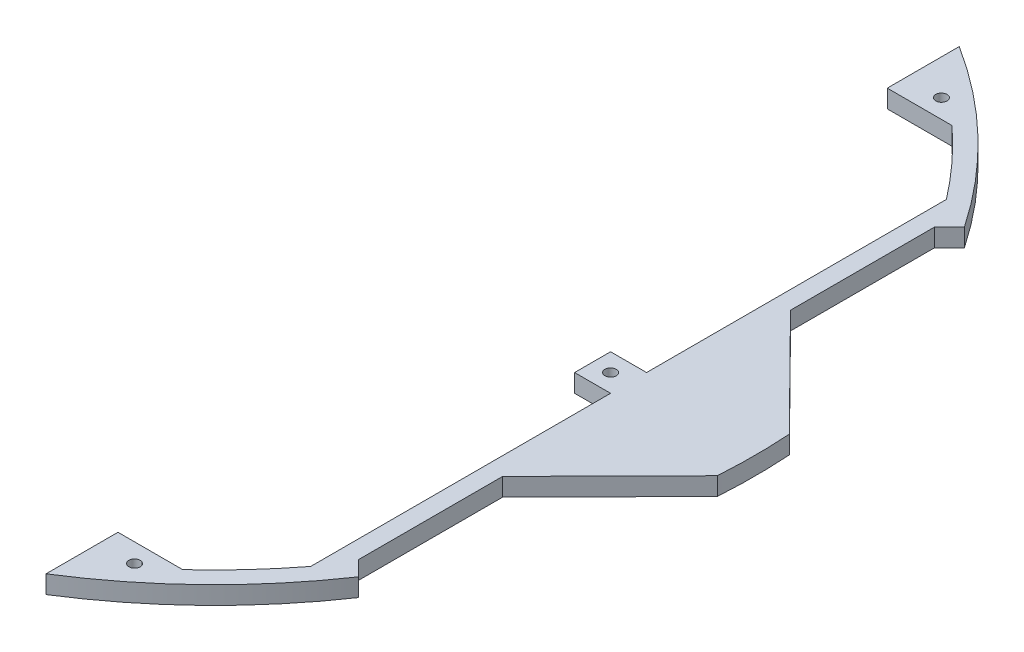
ISO-10303-21;
HEADER;
FILE_DESCRIPTION(('STEP AP214'),'2;1');
FILE_NAME('part.step','',(''),(''),'','','');
FILE_SCHEMA(('AUTOMOTIVE_DESIGN { 1 0 10303 214 1 1 1 1 }'));
ENDSEC;
DATA;
#1=APPLICATION_CONTEXT('core data for automotive mechanical design processes');
#2=APPLICATION_PROTOCOL_DEFINITION('international standard','automotive_design',2000,#1);
#3=PRODUCT_CONTEXT('',#1,'mechanical');
#4=PRODUCT('Part','Part','',(#3));
#5=PRODUCT_RELATED_PRODUCT_CATEGORY('part','',(#4));
#6=PRODUCT_DEFINITION_FORMATION('','',#4);
#7=PRODUCT_DEFINITION_CONTEXT('part definition',#1,'design');
#8=PRODUCT_DEFINITION('design','',#6,#7);
#9=PRODUCT_DEFINITION_SHAPE('','',#8);
#10=(LENGTH_UNIT() NAMED_UNIT(*) SI_UNIT(.MILLI.,.METRE.));
#11=(NAMED_UNIT(*) PLANE_ANGLE_UNIT() SI_UNIT($,.RADIAN.));
#12=(NAMED_UNIT(*) SI_UNIT($,.STERADIAN.) SOLID_ANGLE_UNIT());
#13=UNCERTAINTY_MEASURE_WITH_UNIT(LENGTH_MEASURE(1.E-05),#10,'distance_accuracy_value','');
#14=(GEOMETRIC_REPRESENTATION_CONTEXT(3) GLOBAL_UNCERTAINTY_ASSIGNED_CONTEXT((#13)) GLOBAL_UNIT_ASSIGNED_CONTEXT((#10,
#11,#12)) REPRESENTATION_CONTEXT('',''));
#15=CARTESIAN_POINT('',(0.,0.,0.));
#16=DIRECTION('',(0.,0.,1.));
#17=DIRECTION('',(1.,0.,0.));
#18=AXIS2_PLACEMENT_3D('',#15,#16,#17);
#19=CARTESIAN_POINT('',(133.35,6.35,-6.35000000000048));
#20=DIRECTION('',(1.,0.,0.));
#21=DIRECTION('',(0.,0.,-1.));
#22=AXIS2_PLACEMENT_3D('',#19,#20,#21);
#23=PLANE('',#22);
#24=DIRECTION('',(0.,0.,1.));
#25=VECTOR('',#24,1.);
#26=CARTESIAN_POINT('',(133.35,0.,-6.35000000000048));
#27=LINE('',#26,#25);
#28=CARTESIAN_POINT('',(133.35,0.,-6.35000000000048));
#29=VERTEX_POINT('',#28);
#30=CARTESIAN_POINT('',(133.35,0.,6.34999999999981));
#31=VERTEX_POINT('',#30);
#32=EDGE_CURVE('E203',#29,#31,#27,.T.);
#33=ORIENTED_EDGE('',*,*,#32,.T.);
#34=DIRECTION('',(0.,-1.,0.));
#35=VECTOR('',#34,1.);
#36=CARTESIAN_POINT('',(133.35,6.35,6.34999999999981));
#37=LINE('',#36,#35);
#38=CARTESIAN_POINT('',(133.35,6.35,6.34999999999981));
#39=VERTEX_POINT('',#38);
#40=EDGE_CURVE('E11',#39,#31,#37,.T.);
#41=ORIENTED_EDGE('',*,*,#40,.F.);
#42=DIRECTION('',(0.,0.,1.));
#43=VECTOR('',#42,1.);
#44=CARTESIAN_POINT('',(133.35,6.35,-6.35000000000048));
#45=LINE('',#44,#43);
#46=CARTESIAN_POINT('',(133.35,6.35,-6.35000000000048));
#47=VERTEX_POINT('',#46);
#48=EDGE_CURVE('E253',#47,#39,#45,.T.);
#49=ORIENTED_EDGE('',*,*,#48,.F.);
#50=DIRECTION('',(0.,-1.,0.));
#51=VECTOR('',#50,1.);
#52=CARTESIAN_POINT('',(133.35,6.35,-6.35000000000048));
#53=LINE('',#52,#51);
#54=EDGE_CURVE('E51',#47,#29,#53,.T.);
#55=ORIENTED_EDGE('',*,*,#54,.T.);
#56=EDGE_LOOP('',(#33,#41,#49,#55));
#57=FACE_BOUND('',#56,.T.);
#58=ADVANCED_FACE('F35',(#57),#23,.F.);
#59=CARTESIAN_POINT('',(133.35,6.35,6.34999999999981));
#60=DIRECTION('',(0.,0.,-1.));
#61=DIRECTION('',(-1.,0.,0.));
#62=AXIS2_PLACEMENT_3D('',#59,#60,#61);
#63=PLANE('',#62);
#64=DIRECTION('',(1.,0.,0.));
#65=VECTOR('',#64,1.);
#66=CARTESIAN_POINT('',(133.35,0.,6.34999999999981));
#67=LINE('',#66,#65);
#68=CARTESIAN_POINT('',(146.05,0.,6.34999999999981));
#69=VERTEX_POINT('',#68);
#70=EDGE_CURVE('E205',#31,#69,#67,.T.);
#71=ORIENTED_EDGE('',*,*,#70,.T.);
#72=DIRECTION('',(0.,-1.,0.));
#73=VECTOR('',#72,1.);
#74=CARTESIAN_POINT('',(146.05,6.35,6.34999999999981));
#75=LINE('',#74,#73);
#76=CARTESIAN_POINT('',(146.05,6.35,6.34999999999981));
#77=VERTEX_POINT('',#76);
#78=EDGE_CURVE('E43',#77,#69,#75,.T.);
#79=ORIENTED_EDGE('',*,*,#78,.F.);
#80=DIRECTION('',(1.,0.,0.));
#81=VECTOR('',#80,1.);
#82=CARTESIAN_POINT('',(133.35,6.35,6.34999999999981));
#83=LINE('',#82,#81);
#84=EDGE_CURVE('E125',#39,#77,#83,.T.);
#85=ORIENTED_EDGE('',*,*,#84,.F.);
#86=ORIENTED_EDGE('',*,*,#40,.T.);
#87=EDGE_LOOP('',(#71,#79,#85,#86));
#88=FACE_BOUND('',#87,.T.);
#89=ADVANCED_FACE('F361',(#88),#63,.F.);
#90=CARTESIAN_POINT('',(146.05,6.35,6.34999999999981));
#91=DIRECTION('',(1.,0.,0.));
#92=DIRECTION('',(0.,0.,-1.));
#93=AXIS2_PLACEMENT_3D('',#90,#91,#92);
#94=PLANE('',#93);
#95=DIRECTION('',(0.,0.,1.));
#96=VECTOR('',#95,1.);
#97=CARTESIAN_POINT('',(146.05,0.,6.34999999999981));
#98=LINE('',#97,#96);
#99=CARTESIAN_POINT('',(146.05,0.,112.163363002363));
#100=VERTEX_POINT('',#99);
#101=EDGE_CURVE('E208',#69,#100,#98,.T.);
#102=ORIENTED_EDGE('',*,*,#101,.T.);
#103=DIRECTION('',(0.,-1.,0.));
#104=VECTOR('',#103,1.);
#105=CARTESIAN_POINT('',(146.05,6.35,112.163363002363));
#106=LINE('',#105,#104);
#107=CARTESIAN_POINT('',(146.05,6.35,112.163363002363));
#108=VERTEX_POINT('',#107);
#109=EDGE_CURVE('E290',#108,#100,#106,.T.);
#110=ORIENTED_EDGE('',*,*,#109,.F.);
#111=DIRECTION('',(0.,0.,1.));
#112=VECTOR('',#111,1.);
#113=CARTESIAN_POINT('',(146.05,6.35,6.34999999999981));
#114=LINE('',#113,#112);
#115=EDGE_CURVE('E297',#77,#108,#114,.T.);
#116=ORIENTED_EDGE('',*,*,#115,.F.);
#117=ORIENTED_EDGE('',*,*,#78,.T.);
#118=EDGE_LOOP('',(#102,#110,#116,#117));
#119=FACE_BOUND('',#118,.T.);
#120=ADVANCED_FACE('F295',(#119),#94,.F.);
#121=CARTESIAN_POINT('',(0.,6.35,0.));
#122=DIRECTION('',(0.,-1.,0.));
#123=DIRECTION('',(0.,0.,-1.));
#124=AXIS2_PLACEMENT_3D('',#121,#122,#123);
#125=CYLINDRICAL_SURFACE('',#124,184.15);
#126=CARTESIAN_POINT('',(0.,0.,0.));
#127=DIRECTION('',(0.,1.,0.));
#128=DIRECTION('',(0.,0.,1.));
#129=AXIS2_PLACEMENT_3D('',#126,#127,#128);
#130=CIRCLE('',#129,184.15);
#131=CARTESIAN_POINT('',(124.436872292727,0.,135.744934763709));
#132=VERTEX_POINT('',#131);
#133=EDGE_CURVE('E211',#132,#100,#130,.T.);
#134=ORIENTED_EDGE('',*,*,#133,.F.);
#135=DIRECTION('',(0.,-1.,0.));
#136=VECTOR('',#135,1.);
#137=CARTESIAN_POINT('',(124.436872292727,6.35,135.744934763709));
#138=LINE('',#137,#136);
#139=CARTESIAN_POINT('',(124.436872292727,6.35,135.744934763709));
#140=VERTEX_POINT('',#139);
#141=EDGE_CURVE('E288',#140,#132,#138,.T.);
#142=ORIENTED_EDGE('',*,*,#141,.F.);
#143=CARTESIAN_POINT('',(0.,6.35,0.));
#144=DIRECTION('',(0.,1.,0.));
#145=DIRECTION('',(0.,0.,1.));
#146=AXIS2_PLACEMENT_3D('',#143,#144,#145);
#147=CIRCLE('',#146,184.15);
#148=EDGE_CURVE('E307',#140,#108,#147,.T.);
#149=ORIENTED_EDGE('',*,*,#148,.T.);
#150=ORIENTED_EDGE('',*,*,#109,.T.);
#151=EDGE_LOOP('',(#134,#142,#149,#150));
#152=FACE_BOUND('',#151,.T.);
#153=ADVANCED_FACE('F304',(#152),#125,.F.);
#154=CARTESIAN_POINT('',(101.6,6.35,135.744934763709));
#155=DIRECTION('',(0.,0.,-1.));
#156=DIRECTION('',(-1.,0.,0.));
#157=AXIS2_PLACEMENT_3D('',#154,#155,#156);
#158=PLANE('',#157);
#159=DIRECTION('',(1.,0.,0.));
#160=VECTOR('',#159,1.);
#161=CARTESIAN_POINT('',(101.6,0.,135.744934763709));
#162=LINE('',#161,#160);
#163=CARTESIAN_POINT('',(101.6,0.,135.744934763709));
#164=VERTEX_POINT('',#163);
#165=EDGE_CURVE('E214',#164,#132,#162,.T.);
#166=ORIENTED_EDGE('',*,*,#165,.F.);
#167=DIRECTION('',(0.,-1.,0.));
#168=VECTOR('',#167,1.);
#169=CARTESIAN_POINT('',(101.6,6.35,135.744934763709));
#170=LINE('',#169,#168);
#171=CARTESIAN_POINT('',(101.6,6.35,135.744934763709));
#172=VERTEX_POINT('',#171);
#173=EDGE_CURVE('E286',#172,#164,#170,.T.);
#174=ORIENTED_EDGE('',*,*,#173,.F.);
#175=DIRECTION('',(1.,0.,0.));
#176=VECTOR('',#175,1.);
#177=CARTESIAN_POINT('',(101.6,6.35,135.744934763709));
#178=LINE('',#177,#176);
#179=EDGE_CURVE('E310',#172,#140,#178,.T.);
#180=ORIENTED_EDGE('',*,*,#179,.T.);
#181=ORIENTED_EDGE('',*,*,#141,.T.);
#182=EDGE_LOOP('',(#166,#174,#180,#181));
#183=FACE_BOUND('',#182,.T.);
#184=ADVANCED_FACE('F571',(#183),#158,.T.);
#185=CARTESIAN_POINT('',(101.6,6.35,135.744934763709));
#186=DIRECTION('',(1.,0.,0.));
#187=DIRECTION('',(0.,0.,-1.));
#188=AXIS2_PLACEMENT_3D('',#185,#186,#187);
#189=PLANE('',#188);
#190=DIRECTION('',(0.,0.,1.));
#191=VECTOR('',#190,1.);
#192=CARTESIAN_POINT('',(101.6,0.,135.744934763709));
#193=LINE('',#192,#191);
#194=CARTESIAN_POINT('',(101.6,0.,161.144934763709));
#195=VERTEX_POINT('',#194);
#196=EDGE_CURVE('E217',#164,#195,#193,.T.);
#197=ORIENTED_EDGE('',*,*,#196,.T.);
#198=DIRECTION('',(0.,-1.,0.));
#199=VECTOR('',#198,1.);
#200=CARTESIAN_POINT('',(101.6,6.35,161.144934763709));
#201=LINE('',#200,#199);
#202=CARTESIAN_POINT('',(101.6,6.35,161.144934763709));
#203=VERTEX_POINT('',#202);
#204=EDGE_CURVE('E283',#203,#195,#201,.T.);
#205=ORIENTED_EDGE('',*,*,#204,.F.);
#206=DIRECTION('',(0.,0.,1.));
#207=VECTOR('',#206,1.);
#208=CARTESIAN_POINT('',(101.6,6.35,135.744934763709));
#209=LINE('',#208,#207);
#210=EDGE_CURVE('E312',#172,#203,#209,.T.);
#211=ORIENTED_EDGE('',*,*,#210,.F.);
#212=ORIENTED_EDGE('',*,*,#173,.T.);
#213=EDGE_LOOP('',(#197,#205,#211,#212));
#214=FACE_BOUND('',#213,.T.);
#215=ADVANCED_FACE('F560',(#214),#189,.F.);
#216=CARTESIAN_POINT('',(0.,6.35,0.));
#217=DIRECTION('',(0.,-1.,0.));
#218=DIRECTION('',(0.,0.,-1.));
#219=AXIS2_PLACEMENT_3D('',#216,#217,#218);
#220=CYLINDRICAL_SURFACE('',#219,190.5);
#221=CARTESIAN_POINT('',(0.,0.,0.));
#222=DIRECTION('',(0.,-1.,0.));
#223=DIRECTION('',(0.,0.,-1.));
#224=AXIS2_PLACEMENT_3D('',#221,#222,#223);
#225=CIRCLE('',#224,190.5);
#226=CARTESIAN_POINT('',(157.687433265598,0.,106.887433265598));
#227=VERTEX_POINT('',#226);
#228=EDGE_CURVE('E220',#227,#195,#225,.T.);
#229=ORIENTED_EDGE('',*,*,#228,.F.);
#230=DIRECTION('',(0.,-1.,0.));
#231=VECTOR('',#230,1.);
#232=CARTESIAN_POINT('',(157.687433265598,6.35,106.887433265598));
#233=LINE('',#232,#231);
#234=CARTESIAN_POINT('',(157.687433265598,6.35,106.887433265598));
#235=VERTEX_POINT('',#234);
#236=EDGE_CURVE('E281',#235,#227,#233,.T.);
#237=ORIENTED_EDGE('',*,*,#236,.F.);
#238=CARTESIAN_POINT('',(0.,6.35,0.));
#239=DIRECTION('',(0.,1.,0.));
#240=DIRECTION('',(0.,0.,1.));
#241=AXIS2_PLACEMENT_3D('',#238,#239,#240);
#242=CIRCLE('',#241,190.5);
#243=EDGE_CURVE('E318',#203,#235,#242,.T.);
#244=ORIENTED_EDGE('',*,*,#243,.F.);
#245=ORIENTED_EDGE('',*,*,#204,.T.);
#246=EDGE_LOOP('',(#229,#237,#244,#245));
#247=FACE_BOUND('',#246,.T.);
#248=ADVANCED_FACE('F550',(#247),#220,.T.);
#249=CARTESIAN_POINT('',(152.4,6.35,101.6));
#250=DIRECTION('',(0.707106781186548,0.,-0.707106781186547));
#251=DIRECTION('',(-0.707106781186547,0.,-0.707106781186548));
#252=AXIS2_PLACEMENT_3D('',#249,#250,#251);
#253=PLANE('',#252);
#254=DIRECTION('',(0.707106781186547,0.,0.707106781186548));
#255=VECTOR('',#254,1.);
#256=CARTESIAN_POINT('',(152.4,0.,101.6));
#257=LINE('',#256,#255);
#258=CARTESIAN_POINT('',(152.4,0.,101.6));
#259=VERTEX_POINT('',#258);
#260=EDGE_CURVE('E222',#259,#227,#257,.T.);
#261=ORIENTED_EDGE('',*,*,#260,.F.);
#262=DIRECTION('',(0.,-1.,0.));
#263=VECTOR('',#262,1.);
#264=CARTESIAN_POINT('',(152.4,6.35,101.6));
#265=LINE('',#264,#263);
#266=CARTESIAN_POINT('',(152.4,6.35,101.6));
#267=VERTEX_POINT('',#266);
#268=EDGE_CURVE('E279',#267,#259,#265,.T.);
#269=ORIENTED_EDGE('',*,*,#268,.F.);
#270=DIRECTION('',(0.707106781186547,0.,0.707106781186548));
#271=VECTOR('',#270,1.);
#272=CARTESIAN_POINT('',(152.4,6.35,101.6));
#273=LINE('',#272,#271);
#274=EDGE_CURVE('E320',#267,#235,#273,.T.);
#275=ORIENTED_EDGE('',*,*,#274,.T.);
#276=ORIENTED_EDGE('',*,*,#236,.T.);
#277=EDGE_LOOP('',(#261,#269,#275,#276));
#278=FACE_BOUND('',#277,.T.);
#279=ADVANCED_FACE('F540',(#278),#253,.T.);
#280=CARTESIAN_POINT('',(152.4,6.35,101.6));
#281=DIRECTION('',(-1.,0.,0.));
#282=DIRECTION('',(0.,0.,1.));
#283=AXIS2_PLACEMENT_3D('',#280,#281,#282);
#284=PLANE('',#283);
#285=DIRECTION('',(0.,0.,-1.));
#286=VECTOR('',#285,1.);
#287=CARTESIAN_POINT('',(152.4,0.,101.6));
#288=LINE('',#287,#286);
#289=CARTESIAN_POINT('',(152.4,0.,50.8));
#290=VERTEX_POINT('',#289);
#291=EDGE_CURVE('E225',#259,#290,#288,.T.);
#292=ORIENTED_EDGE('',*,*,#291,.T.);
#293=DIRECTION('',(0.,-1.,0.));
#294=VECTOR('',#293,1.);
#295=CARTESIAN_POINT('',(152.4,6.35,50.8));
#296=LINE('',#295,#294);
#297=CARTESIAN_POINT('',(152.4,6.35,50.8));
#298=VERTEX_POINT('',#297);
#299=EDGE_CURVE('E276',#298,#290,#296,.T.);
#300=ORIENTED_EDGE('',*,*,#299,.F.);
#301=DIRECTION('',(0.,0.,-1.));
#302=VECTOR('',#301,1.);
#303=CARTESIAN_POINT('',(152.4,6.35,101.6));
#304=LINE('',#303,#302);
#305=EDGE_CURVE('E323',#267,#298,#304,.T.);
#306=ORIENTED_EDGE('',*,*,#305,.F.);
#307=ORIENTED_EDGE('',*,*,#268,.T.);
#308=EDGE_LOOP('',(#292,#300,#306,#307));
#309=FACE_BOUND('',#308,.T.);
#310=ADVANCED_FACE('F530',(#309),#284,.F.);
#311=CARTESIAN_POINT('',(152.4,6.35,50.8));
#312=DIRECTION('',(-0.711050401301732,0.,-0.703141043325339));
#313=DIRECTION('',(-0.703141043325339,0.,0.711050401301732));
#314=AXIS2_PLACEMENT_3D('',#311,#312,#313);
#315=PLANE('',#314);
#316=DIRECTION('',(0.703141043325339,0.,-0.711050401301732));
#317=VECTOR('',#316,1.);
#318=CARTESIAN_POINT('',(152.4,0.,50.8));
#319=LINE('',#318,#317);
#320=CARTESIAN_POINT('',(190.076195248116,0.,12.7));
#321=VERTEX_POINT('',#320);
#322=EDGE_CURVE('E227',#290,#321,#319,.T.);
#323=ORIENTED_EDGE('',*,*,#322,.T.);
#324=DIRECTION('',(0.,-1.,0.));
#325=VECTOR('',#324,1.);
#326=CARTESIAN_POINT('',(190.076195248116,6.35,12.7));
#327=LINE('',#326,#325);
#328=CARTESIAN_POINT('',(190.076195248116,6.35,12.7));
#329=VERTEX_POINT('',#328);
#330=EDGE_CURVE('E273',#329,#321,#327,.T.);
#331=ORIENTED_EDGE('',*,*,#330,.F.);
#332=DIRECTION('',(0.703141043325339,0.,-0.711050401301732));
#333=VECTOR('',#332,1.);
#334=CARTESIAN_POINT('',(152.4,6.35,50.8));
#335=LINE('',#334,#333);
#336=EDGE_CURVE('E325',#298,#329,#335,.T.);
#337=ORIENTED_EDGE('',*,*,#336,.F.);
#338=ORIENTED_EDGE('',*,*,#299,.T.);
#339=EDGE_LOOP('',(#323,#331,#337,#338));
#340=FACE_BOUND('',#339,.T.);
#341=ADVANCED_FACE('F520',(#340),#315,.F.);
#342=CARTESIAN_POINT('',(0.,6.35,0.));
#343=DIRECTION('',(0.,-1.,0.));
#344=DIRECTION('',(0.,0.,-1.));
#345=AXIS2_PLACEMENT_3D('',#342,#343,#344);
#346=CYLINDRICAL_SURFACE('',#345,190.5);
#347=CARTESIAN_POINT('',(0.,0.,0.));
#348=DIRECTION('',(0.,1.,0.));
#349=DIRECTION('',(0.,0.,1.));
#350=AXIS2_PLACEMENT_3D('',#347,#348,#349);
#351=CIRCLE('',#350,190.5);
#352=CARTESIAN_POINT('',(190.076195248116,0.,-12.7));
#353=VERTEX_POINT('',#352);
#354=EDGE_CURVE('E229',#321,#353,#351,.T.);
#355=ORIENTED_EDGE('',*,*,#354,.T.);
#356=DIRECTION('',(0.,-1.,0.));
#357=VECTOR('',#356,1.);
#358=CARTESIAN_POINT('',(190.076195248116,6.35,-12.7));
#359=LINE('',#358,#357);
#360=CARTESIAN_POINT('',(190.076195248116,6.35,-12.7));
#361=VERTEX_POINT('',#360);
#362=EDGE_CURVE('E271',#361,#353,#359,.T.);
#363=ORIENTED_EDGE('',*,*,#362,.F.);
#364=CARTESIAN_POINT('',(0.,6.35,0.));
#365=DIRECTION('',(0.,1.,0.));
#366=DIRECTION('',(0.,0.,1.));
#367=AXIS2_PLACEMENT_3D('',#364,#365,#366);
#368=CIRCLE('',#367,190.5);
#369=EDGE_CURVE('E327',#329,#361,#368,.T.);
#370=ORIENTED_EDGE('',*,*,#369,.F.);
#371=ORIENTED_EDGE('',*,*,#330,.T.);
#372=EDGE_LOOP('',(#355,#363,#370,#371));
#373=FACE_BOUND('',#372,.T.);
#374=ADVANCED_FACE('F510',(#373),#346,.T.);
#375=CARTESIAN_POINT('',(152.4,6.35,-50.8));
#376=DIRECTION('',(0.711050401301732,0.,-0.703141043325339));
#377=DIRECTION('',(-0.703141043325339,0.,-0.711050401301732));
#378=AXIS2_PLACEMENT_3D('',#375,#376,#377);
#379=PLANE('',#378);
#380=DIRECTION('',(0.703141043325339,0.,0.711050401301732));
#381=VECTOR('',#380,1.);
#382=CARTESIAN_POINT('',(152.4,0.,-50.8));
#383=LINE('',#382,#381);
#384=CARTESIAN_POINT('',(152.4,0.,-50.8));
#385=VERTEX_POINT('',#384);
#386=EDGE_CURVE('E232',#385,#353,#383,.T.);
#387=ORIENTED_EDGE('',*,*,#386,.F.);
#388=DIRECTION('',(0.,-1.,0.));
#389=VECTOR('',#388,1.);
#390=CARTESIAN_POINT('',(152.4,6.35,-50.8));
#391=LINE('',#390,#389);
#392=CARTESIAN_POINT('',(152.4,6.35,-50.8));
#393=VERTEX_POINT('',#392);
#394=EDGE_CURVE('E269',#393,#385,#391,.T.);
#395=ORIENTED_EDGE('',*,*,#394,.F.);
#396=DIRECTION('',(0.703141043325339,0.,0.711050401301732));
#397=VECTOR('',#396,1.);
#398=CARTESIAN_POINT('',(152.4,6.35,-50.8));
#399=LINE('',#398,#397);
#400=EDGE_CURVE('E329',#393,#361,#399,.T.);
#401=ORIENTED_EDGE('',*,*,#400,.T.);
#402=ORIENTED_EDGE('',*,*,#362,.T.);
#403=EDGE_LOOP('',(#387,#395,#401,#402));
#404=FACE_BOUND('',#403,.T.);
#405=ADVANCED_FACE('F500',(#404),#379,.T.);
#406=CARTESIAN_POINT('',(152.4,6.35,-50.8));
#407=DIRECTION('',(-1.,0.,0.));
#408=DIRECTION('',(0.,0.,1.));
#409=AXIS2_PLACEMENT_3D('',#406,#407,#408);
#410=PLANE('',#409);
#411=DIRECTION('',(0.,0.,-1.));
#412=VECTOR('',#411,1.);
#413=CARTESIAN_POINT('',(152.4,0.,-50.8));
#414=LINE('',#413,#412);
#415=CARTESIAN_POINT('',(152.4,0.,-101.6));
#416=VERTEX_POINT('',#415);
#417=EDGE_CURVE('E235',#385,#416,#414,.T.);
#418=ORIENTED_EDGE('',*,*,#417,.T.);
#419=DIRECTION('',(0.,-1.,0.));
#420=VECTOR('',#419,1.);
#421=CARTESIAN_POINT('',(152.4,6.35,-101.6));
#422=LINE('',#421,#420);
#423=CARTESIAN_POINT('',(152.4,6.35,-101.6));
#424=VERTEX_POINT('',#423);
#425=EDGE_CURVE('E266',#424,#416,#422,.T.);
#426=ORIENTED_EDGE('',*,*,#425,.F.);
#427=DIRECTION('',(0.,0.,-1.));
#428=VECTOR('',#427,1.);
#429=CARTESIAN_POINT('',(152.4,6.35,-50.8));
#430=LINE('',#429,#428);
#431=EDGE_CURVE('E332',#393,#424,#430,.T.);
#432=ORIENTED_EDGE('',*,*,#431,.F.);
#433=ORIENTED_EDGE('',*,*,#394,.T.);
#434=EDGE_LOOP('',(#418,#426,#432,#433));
#435=FACE_BOUND('',#434,.T.);
#436=ADVANCED_FACE('F490',(#435),#410,.F.);
#437=CARTESIAN_POINT('',(152.4,6.35,-101.6));
#438=DIRECTION('',(-0.707106781186548,0.,-0.707106781186547));
#439=DIRECTION('',(-0.707106781186547,0.,0.707106781186548));
#440=AXIS2_PLACEMENT_3D('',#437,#438,#439);
#441=PLANE('',#440);
#442=DIRECTION('',(0.707106781186547,0.,-0.707106781186548));
#443=VECTOR('',#442,1.);
#444=CARTESIAN_POINT('',(152.4,0.,-101.6));
#445=LINE('',#444,#443);
#446=CARTESIAN_POINT('',(157.687433265598,0.,-106.887433265598));
#447=VERTEX_POINT('',#446);
#448=EDGE_CURVE('E237',#416,#447,#445,.T.);
#449=ORIENTED_EDGE('',*,*,#448,.T.);
#450=DIRECTION('',(0.,-1.,0.));
#451=VECTOR('',#450,1.);
#452=CARTESIAN_POINT('',(157.687433265598,6.35,-106.887433265598));
#453=LINE('',#452,#451);
#454=CARTESIAN_POINT('',(157.687433265598,6.35,-106.887433265598));
#455=VERTEX_POINT('',#454);
#456=EDGE_CURVE('E263',#455,#447,#453,.T.);
#457=ORIENTED_EDGE('',*,*,#456,.F.);
#458=DIRECTION('',(0.707106781186547,0.,-0.707106781186548));
#459=VECTOR('',#458,1.);
#460=CARTESIAN_POINT('',(152.4,6.35,-101.6));
#461=LINE('',#460,#459);
#462=EDGE_CURVE('E334',#424,#455,#461,.T.);
#463=ORIENTED_EDGE('',*,*,#462,.F.);
#464=ORIENTED_EDGE('',*,*,#425,.T.);
#465=EDGE_LOOP('',(#449,#457,#463,#464));
#466=FACE_BOUND('',#465,.T.);
#467=ADVANCED_FACE('F479',(#466),#441,.F.);
#468=CARTESIAN_POINT('',(0.,6.35,0.));
#469=DIRECTION('',(0.,-1.,0.));
#470=DIRECTION('',(0.,0.,-1.));
#471=AXIS2_PLACEMENT_3D('',#468,#469,#470);
#472=CYLINDRICAL_SURFACE('',#471,190.5);
#473=CARTESIAN_POINT('',(0.,0.,0.));
#474=DIRECTION('',(0.,1.,0.));
#475=DIRECTION('',(0.,0.,1.));
#476=AXIS2_PLACEMENT_3D('',#473,#474,#475);
#477=CIRCLE('',#476,190.5);
#478=CARTESIAN_POINT('',(101.6,0.,-161.144934763709));
#479=VERTEX_POINT('',#478);
#480=EDGE_CURVE('E240',#447,#479,#477,.T.);
#481=ORIENTED_EDGE('',*,*,#480,.T.);
#482=DIRECTION('',(0.,-1.,0.));
#483=VECTOR('',#482,1.);
#484=CARTESIAN_POINT('',(101.6,6.35,-161.144934763709));
#485=LINE('',#484,#483);
#486=CARTESIAN_POINT('',(101.6,6.35,-161.144934763709));
#487=VERTEX_POINT('',#486);
#488=EDGE_CURVE('E260',#487,#479,#485,.T.);
#489=ORIENTED_EDGE('',*,*,#488,.F.);
#490=CARTESIAN_POINT('',(0.,6.35,0.));
#491=DIRECTION('',(0.,1.,0.));
#492=DIRECTION('',(0.,0.,1.));
#493=AXIS2_PLACEMENT_3D('',#490,#491,#492);
#494=CIRCLE('',#493,190.5);
#495=EDGE_CURVE('E336',#455,#487,#494,.T.);
#496=ORIENTED_EDGE('',*,*,#495,.F.);
#497=ORIENTED_EDGE('',*,*,#456,.T.);
#498=EDGE_LOOP('',(#481,#489,#496,#497));
#499=FACE_BOUND('',#498,.T.);
#500=ADVANCED_FACE('F470',(#499),#472,.T.);
#501=CARTESIAN_POINT('',(101.6,6.35,-161.144934763709));
#502=DIRECTION('',(1.,0.,0.));
#503=DIRECTION('',(0.,0.,-1.));
#504=AXIS2_PLACEMENT_3D('',#501,#502,#503);
#505=PLANE('',#504);
#506=DIRECTION('',(0.,0.,1.));
#507=VECTOR('',#506,1.);
#508=CARTESIAN_POINT('',(101.6,0.,-161.144934763709));
#509=LINE('',#508,#507);
#510=CARTESIAN_POINT('',(101.6,0.,-135.744934763709));
#511=VERTEX_POINT('',#510);
#512=EDGE_CURVE('E242',#479,#511,#509,.T.);
#513=ORIENTED_EDGE('',*,*,#512,.T.);
#514=DIRECTION('',(0.,-1.,0.));
#515=VECTOR('',#514,1.);
#516=CARTESIAN_POINT('',(101.6,6.35,-135.744934763709));
#517=LINE('',#516,#515);
#518=CARTESIAN_POINT('',(101.6,6.35,-135.744934763709));
#519=VERTEX_POINT('',#518);
#520=EDGE_CURVE('E257',#519,#511,#517,.T.);
#521=ORIENTED_EDGE('',*,*,#520,.F.);
#522=DIRECTION('',(0.,0.,1.));
#523=VECTOR('',#522,1.);
#524=CARTESIAN_POINT('',(101.6,6.35,-161.144934763709));
#525=LINE('',#524,#523);
#526=EDGE_CURVE('E338',#487,#519,#525,.T.);
#527=ORIENTED_EDGE('',*,*,#526,.F.);
#528=ORIENTED_EDGE('',*,*,#488,.T.);
#529=EDGE_LOOP('',(#513,#521,#527,#528));
#530=FACE_BOUND('',#529,.T.);
#531=ADVANCED_FACE('F344',(#530),#505,.F.);
#532=CARTESIAN_POINT('',(101.6,6.35,-135.744934763709));
#533=DIRECTION('',(0.,0.,-1.));
#534=DIRECTION('',(-1.,0.,0.));
#535=AXIS2_PLACEMENT_3D('',#532,#533,#534);
#536=PLANE('',#535);
#537=DIRECTION('',(1.,0.,0.));
#538=VECTOR('',#537,1.);
#539=CARTESIAN_POINT('',(101.6,0.,-135.744934763709));
#540=LINE('',#539,#538);
#541=CARTESIAN_POINT('',(124.436872292727,0.,-135.744934763709));
#542=VERTEX_POINT('',#541);
#543=EDGE_CURVE('E244',#511,#542,#540,.T.);
#544=ORIENTED_EDGE('',*,*,#543,.T.);
#545=DIRECTION('',(0.,-1.,0.));
#546=VECTOR('',#545,1.);
#547=CARTESIAN_POINT('',(124.436872292727,6.35,-135.744934763709));
#548=LINE('',#547,#546);
#549=CARTESIAN_POINT('',(124.436872292727,6.35,-135.744934763709));
#550=VERTEX_POINT('',#549);
#551=EDGE_CURVE('E186',#550,#542,#548,.T.);
#552=ORIENTED_EDGE('',*,*,#551,.F.);
#553=DIRECTION('',(1.,0.,0.));
#554=VECTOR('',#553,1.);
#555=CARTESIAN_POINT('',(101.6,6.35,-135.744934763709));
#556=LINE('',#555,#554);
#557=EDGE_CURVE('E194',#519,#550,#556,.T.);
#558=ORIENTED_EDGE('',*,*,#557,.F.);
#559=ORIENTED_EDGE('',*,*,#520,.T.);
#560=EDGE_LOOP('',(#544,#552,#558,#559));
#561=FACE_BOUND('',#560,.T.);
#562=ADVANCED_FACE('F348',(#561),#536,.F.);
#563=CARTESIAN_POINT('',(0.,6.35,0.));
#564=DIRECTION('',(0.,-1.,0.));
#565=DIRECTION('',(0.,0.,-1.));
#566=AXIS2_PLACEMENT_3D('',#563,#564,#565);
#567=CYLINDRICAL_SURFACE('',#566,184.15);
#568=CARTESIAN_POINT('',(0.,0.,0.));
#569=DIRECTION('',(0.,1.,0.));
#570=DIRECTION('',(0.,0.,1.));
#571=AXIS2_PLACEMENT_3D('',#568,#569,#570);
#572=CIRCLE('',#571,184.15);
#573=CARTESIAN_POINT('',(146.05,0.,-112.163363002363));
#574=VERTEX_POINT('',#573);
#575=EDGE_CURVE('E182',#574,#542,#572,.T.);
#576=ORIENTED_EDGE('',*,*,#575,.F.);
#577=DIRECTION('',(0.,-1.,0.));
#578=VECTOR('',#577,1.);
#579=CARTESIAN_POINT('',(146.05,6.35,-112.163363002363));
#580=LINE('',#579,#578);
#581=CARTESIAN_POINT('',(146.05,6.35,-112.163363002363));
#582=VERTEX_POINT('',#581);
#583=EDGE_CURVE('E177',#582,#574,#580,.T.);
#584=ORIENTED_EDGE('',*,*,#583,.F.);
#585=CARTESIAN_POINT('',(0.,6.35,0.));
#586=DIRECTION('',(0.,1.,0.));
#587=DIRECTION('',(0.,0.,1.));
#588=AXIS2_PLACEMENT_3D('',#585,#586,#587);
#589=CIRCLE('',#588,184.15);
#590=EDGE_CURVE('E180',#582,#550,#589,.T.);
#591=ORIENTED_EDGE('',*,*,#590,.T.);
#592=ORIENTED_EDGE('',*,*,#551,.T.);
#593=EDGE_LOOP('',(#576,#584,#591,#592));
#594=FACE_BOUND('',#593,.T.);
#595=ADVANCED_FACE('F179',(#594),#567,.F.);
#596=CARTESIAN_POINT('',(146.05,6.35,-6.35000000000048));
#597=DIRECTION('',(-1.,0.,0.));
#598=DIRECTION('',(0.,0.,1.));
#599=AXIS2_PLACEMENT_3D('',#596,#597,#598);
#600=PLANE('',#599);
#601=DIRECTION('',(0.,0.,-1.));
#602=VECTOR('',#601,1.);
#603=CARTESIAN_POINT('',(146.05,0.,-6.35000000000048));
#604=LINE('',#603,#602);
#605=CARTESIAN_POINT('',(146.05,0.,-6.35000000000048));
#606=VERTEX_POINT('',#605);
#607=EDGE_CURVE('E248',#606,#574,#604,.T.);
#608=ORIENTED_EDGE('',*,*,#607,.F.);
#609=DIRECTION('',(0.,-1.,0.));
#610=VECTOR('',#609,1.);
#611=CARTESIAN_POINT('',(146.05,6.35,-6.35000000000048));
#612=LINE('',#611,#610);
#613=CARTESIAN_POINT('',(146.05,6.35,-6.35000000000048));
#614=VERTEX_POINT('',#613);
#615=EDGE_CURVE('E113',#614,#606,#612,.T.);
#616=ORIENTED_EDGE('',*,*,#615,.F.);
#617=DIRECTION('',(0.,0.,-1.));
#618=VECTOR('',#617,1.);
#619=CARTESIAN_POINT('',(146.05,6.35,-6.35000000000048));
#620=LINE('',#619,#618);
#621=EDGE_CURVE('E192',#614,#582,#620,.T.);
#622=ORIENTED_EDGE('',*,*,#621,.T.);
#623=ORIENTED_EDGE('',*,*,#583,.T.);
#624=EDGE_LOOP('',(#608,#616,#622,#623));
#625=FACE_BOUND('',#624,.T.);
#626=ADVANCED_FACE('F197',(#625),#600,.T.);
#627=CARTESIAN_POINT('',(133.35,6.35,-6.35000000000048));
#628=DIRECTION('',(0.,0.,-1.));
#629=DIRECTION('',(-1.,0.,0.));
#630=AXIS2_PLACEMENT_3D('',#627,#628,#629);
#631=PLANE('',#630);
#632=DIRECTION('',(1.,0.,0.));
#633=VECTOR('',#632,1.);
#634=CARTESIAN_POINT('',(133.35,0.,-6.35000000000048));
#635=LINE('',#634,#633);
#636=EDGE_CURVE('E250',#29,#606,#635,.T.);
#637=ORIENTED_EDGE('',*,*,#636,.F.);
#638=ORIENTED_EDGE('',*,*,#54,.F.);
#639=DIRECTION('',(1.,0.,0.));
#640=VECTOR('',#639,1.);
#641=CARTESIAN_POINT('',(133.35,6.35,-6.35000000000048));
#642=LINE('',#641,#640);
#643=EDGE_CURVE('E198',#47,#614,#642,.T.);
#644=ORIENTED_EDGE('',*,*,#643,.T.);
#645=ORIENTED_EDGE('',*,*,#615,.T.);
#646=EDGE_LOOP('',(#637,#638,#644,#645));
#647=FACE_BOUND('',#646,.T.);
#648=ADVANCED_FACE('F349',(#647),#631,.T.);
#649=CARTESIAN_POINT('',(0.,6.35,0.));
#650=DIRECTION('',(0.,1.,0.));
#651=DIRECTION('',(0.,0.,1.));
#652=AXIS2_PLACEMENT_3D('',#649,#650,#651);
#653=PLANE('',#652);
#654=CARTESIAN_POINT('',(114.080655545623,6.35,-142.381475201661));
#655=DIRECTION('',(0.,1.,0.));
#656=DIRECTION('',(0.,0.,1.));
#657=AXIS2_PLACEMENT_3D('',#654,#655,#656);
#658=CIRCLE('',#657,2.);
#659=CARTESIAN_POINT('',(114.080655545623,6.35,-140.381475201661));
#660=VERTEX_POINT('',#659);
#661=EDGE_CURVE('E377',#660,#660,#658,.T.);
#662=ORIENTED_EDGE('',*,*,#661,.F.);
#663=EDGE_LOOP('',(#662));
#664=FACE_BOUND('',#663,.T.);
#665=CARTESIAN_POINT('',(114.080655545623,6.35,142.381475201661));
#666=DIRECTION('',(0.,-1.,0.));
#667=DIRECTION('',(0.,0.,-1.));
#668=AXIS2_PLACEMENT_3D('',#665,#666,#667);
#669=CIRCLE('',#668,2.);
#670=CARTESIAN_POINT('',(114.080655545623,6.35,140.381475201661));
#671=VERTEX_POINT('',#670);
#672=EDGE_CURVE('E374',#671,#671,#669,.T.);
#673=ORIENTED_EDGE('',*,*,#672,.T.);
#674=EDGE_LOOP('',(#673));
#675=FACE_BOUND('',#674,.T.);
#676=CARTESIAN_POINT('',(139.7,6.35,-3.36536354339501E-13));
#677=DIRECTION('',(0.,1.,0.));
#678=DIRECTION('',(0.,0.,1.));
#679=AXIS2_PLACEMENT_3D('',#676,#677,#678);
#680=CIRCLE('',#679,2.);
#681=CARTESIAN_POINT('',(139.7,6.35,1.99999999999966));
#682=VERTEX_POINT('',#681);
#683=EDGE_CURVE('E368',#682,#682,#680,.T.);
#684=ORIENTED_EDGE('',*,*,#683,.F.);
#685=EDGE_LOOP('',(#684));
#686=FACE_BOUND('',#685,.T.);
#687=ORIENTED_EDGE('',*,*,#48,.T.);
#688=ORIENTED_EDGE('',*,*,#84,.T.);
#689=ORIENTED_EDGE('',*,*,#115,.T.);
#690=ORIENTED_EDGE('',*,*,#148,.F.);
#691=ORIENTED_EDGE('',*,*,#179,.F.);
#692=ORIENTED_EDGE('',*,*,#210,.T.);
#693=ORIENTED_EDGE('',*,*,#243,.T.);
#694=ORIENTED_EDGE('',*,*,#274,.F.);
#695=ORIENTED_EDGE('',*,*,#305,.T.);
#696=ORIENTED_EDGE('',*,*,#336,.T.);
#697=ORIENTED_EDGE('',*,*,#369,.T.);
#698=ORIENTED_EDGE('',*,*,#400,.F.);
#699=ORIENTED_EDGE('',*,*,#431,.T.);
#700=ORIENTED_EDGE('',*,*,#462,.T.);
#701=ORIENTED_EDGE('',*,*,#495,.T.);
#702=ORIENTED_EDGE('',*,*,#526,.T.);
#703=ORIENTED_EDGE('',*,*,#557,.T.);
#704=ORIENTED_EDGE('',*,*,#590,.F.);
#705=ORIENTED_EDGE('',*,*,#621,.F.);
#706=ORIENTED_EDGE('',*,*,#643,.F.);
#707=EDGE_LOOP('',(#687,#688,#689,#690,#691,#692,#693,#694,#695,#696,#697,#698,#699,#700,#701,
#702,#703,#704,#705,#706));
#708=FACE_BOUND('',#707,.T.);
#709=ADVANCED_FACE('F190',(#664,#675,#686,#708),#653,.T.);
#710=CARTESIAN_POINT('',(0.,0.,0.));
#711=DIRECTION('',(0.,1.,0.));
#712=DIRECTION('',(0.,0.,1.));
#713=AXIS2_PLACEMENT_3D('',#710,#711,#712);
#714=PLANE('',#713);
#715=CARTESIAN_POINT('',(114.080655545623,0.,-142.381475201661));
#716=DIRECTION('',(0.,1.,0.));
#717=DIRECTION('',(0.,0.,1.));
#718=AXIS2_PLACEMENT_3D('',#715,#716,#717);
#719=CIRCLE('',#718,2.);
#720=CARTESIAN_POINT('',(114.080655545623,0.,-140.381475201661));
#721=VERTEX_POINT('',#720);
#722=EDGE_CURVE('E380',#721,#721,#719,.T.);
#723=ORIENTED_EDGE('',*,*,#722,.T.);
#724=EDGE_LOOP('',(#723));
#725=FACE_BOUND('',#724,.T.);
#726=CARTESIAN_POINT('',(114.080655545623,0.,142.381475201661));
#727=DIRECTION('',(0.,-1.,0.));
#728=DIRECTION('',(0.,0.,-1.));
#729=AXIS2_PLACEMENT_3D('',#726,#727,#728);
#730=CIRCLE('',#729,2.);
#731=CARTESIAN_POINT('',(114.080655545623,0.,140.381475201661));
#732=VERTEX_POINT('',#731);
#733=EDGE_CURVE('E371',#732,#732,#730,.T.);
#734=ORIENTED_EDGE('',*,*,#733,.F.);
#735=EDGE_LOOP('',(#734));
#736=FACE_BOUND('',#735,.T.);
#737=CARTESIAN_POINT('',(139.7,0.,-3.36536354339501E-13));
#738=DIRECTION('',(0.,1.,0.));
#739=DIRECTION('',(0.,0.,1.));
#740=AXIS2_PLACEMENT_3D('',#737,#738,#739);
#741=CIRCLE('',#740,2.);
#742=CARTESIAN_POINT('',(139.7,0.,1.99999999999966));
#743=VERTEX_POINT('',#742);
#744=EDGE_CURVE('E206',#743,#743,#741,.T.);
#745=ORIENTED_EDGE('',*,*,#744,.T.);
#746=EDGE_LOOP('',(#745));
#747=FACE_BOUND('',#746,.T.);
#748=ORIENTED_EDGE('',*,*,#32,.F.);
#749=ORIENTED_EDGE('',*,*,#636,.T.);
#750=ORIENTED_EDGE('',*,*,#607,.T.);
#751=ORIENTED_EDGE('',*,*,#575,.T.);
#752=ORIENTED_EDGE('',*,*,#543,.F.);
#753=ORIENTED_EDGE('',*,*,#512,.F.);
#754=ORIENTED_EDGE('',*,*,#480,.F.);
#755=ORIENTED_EDGE('',*,*,#448,.F.);
#756=ORIENTED_EDGE('',*,*,#417,.F.);
#757=ORIENTED_EDGE('',*,*,#386,.T.);
#758=ORIENTED_EDGE('',*,*,#354,.F.);
#759=ORIENTED_EDGE('',*,*,#322,.F.);
#760=ORIENTED_EDGE('',*,*,#291,.F.);
#761=ORIENTED_EDGE('',*,*,#260,.T.);
#762=ORIENTED_EDGE('',*,*,#228,.T.);
#763=ORIENTED_EDGE('',*,*,#196,.F.);
#764=ORIENTED_EDGE('',*,*,#165,.T.);
#765=ORIENTED_EDGE('',*,*,#133,.T.);
#766=ORIENTED_EDGE('',*,*,#101,.F.);
#767=ORIENTED_EDGE('',*,*,#70,.F.);
#768=EDGE_LOOP('',(#748,#749,#750,#751,#752,#753,#754,#755,#756,#757,#758,#759,#760,#761,#762,
#763,#764,#765,#766,#767));
#769=FACE_BOUND('',#768,.T.);
#770=ADVANCED_FACE('F299',(#725,#736,#747,#769),#714,.F.);
#771=CARTESIAN_POINT('',(139.7,0.,-3.36536354339501E-13));
#772=DIRECTION('',(0.,1.,0.));
#773=DIRECTION('',(0.,0.,1.));
#774=AXIS2_PLACEMENT_3D('',#771,#772,#773);
#775=CYLINDRICAL_SURFACE('',#774,2.);
#776=ORIENTED_EDGE('',*,*,#744,.F.);
#777=EDGE_LOOP('',(#776));
#778=FACE_BOUND('',#777,.T.);
#779=ORIENTED_EDGE('',*,*,#683,.T.);
#780=EDGE_LOOP('',(#779));
#781=FACE_BOUND('',#780,.T.);
#782=ADVANCED_FACE('F392',(#778,#781),#775,.F.);
#783=CARTESIAN_POINT('',(114.080655545623,0.,142.381475201661));
#784=DIRECTION('',(0.,1.,0.));
#785=DIRECTION('',(0.,0.,1.));
#786=AXIS2_PLACEMENT_3D('',#783,#784,#785);
#787=CYLINDRICAL_SURFACE('',#786,2.);
#788=ORIENTED_EDGE('',*,*,#733,.T.);
#789=EDGE_LOOP('',(#788));
#790=FACE_BOUND('',#789,.T.);
#791=ORIENTED_EDGE('',*,*,#672,.F.);
#792=EDGE_LOOP('',(#791));
#793=FACE_BOUND('',#792,.T.);
#794=ADVANCED_FACE('F394',(#790,#793),#787,.F.);
#795=CARTESIAN_POINT('',(114.080655545623,0.,-142.381475201661));
#796=DIRECTION('',(0.,1.,0.));
#797=DIRECTION('',(0.,0.,1.));
#798=AXIS2_PLACEMENT_3D('',#795,#796,#797);
#799=CYLINDRICAL_SURFACE('',#798,2.);
#800=ORIENTED_EDGE('',*,*,#722,.F.);
#801=EDGE_LOOP('',(#800));
#802=FACE_BOUND('',#801,.T.);
#803=ORIENTED_EDGE('',*,*,#661,.T.);
#804=EDGE_LOOP('',(#803));
#805=FACE_BOUND('',#804,.T.);
#806=ADVANCED_FACE('F386',(#802,#805),#799,.F.);
#807=CLOSED_SHELL('',(#58,#89,#120,#153,#184,#215,#248,#279,#310,#341,#374,#405,#436,#467,#500,
#531,#562,#595,#626,#648,#709,#770,#782,#794,#806));
#808=MANIFOLD_SOLID_BREP('B2',#807);
#809=ADVANCED_BREP_SHAPE_REPRESENTATION('',(#18,#808),#14);
#810=SHAPE_DEFINITION_REPRESENTATION(#9,#809);
ENDSEC;
END-ISO-10303-21;
